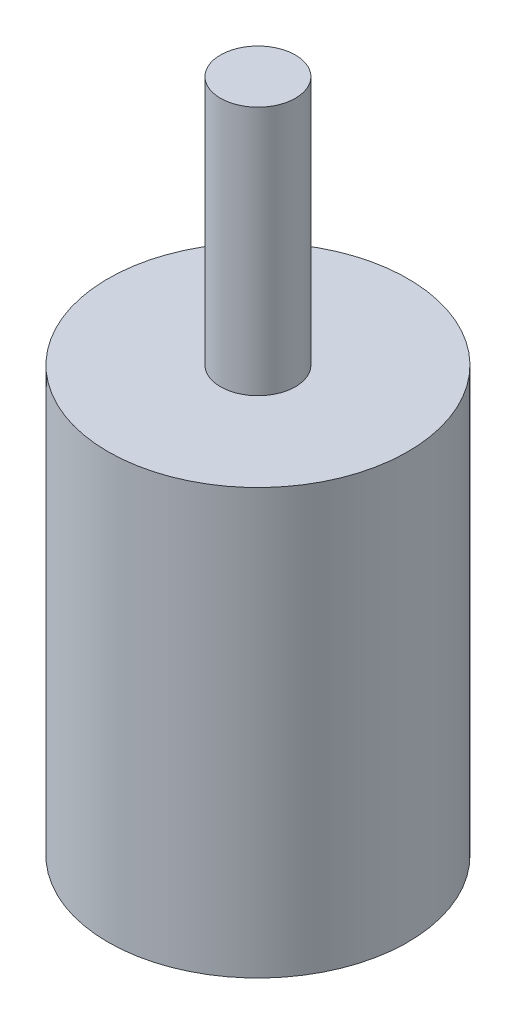
ISO-10303-21;
HEADER;
FILE_DESCRIPTION(('STEP AP214'),'2;1');
FILE_NAME('part.step','',(''),(''),'','','');
FILE_SCHEMA(('AUTOMOTIVE_DESIGN { 1 0 10303 214 1 1 1 1 }'));
ENDSEC;
DATA;
#1=APPLICATION_CONTEXT('core data for automotive mechanical design processes');
#2=APPLICATION_PROTOCOL_DEFINITION('international standard','automotive_design',2000,#1);
#3=PRODUCT_CONTEXT('',#1,'mechanical');
#4=PRODUCT('Part','Part','',(#3));
#5=PRODUCT_RELATED_PRODUCT_CATEGORY('part','',(#4));
#6=PRODUCT_DEFINITION_FORMATION('','',#4);
#7=PRODUCT_DEFINITION_CONTEXT('part definition',#1,'design');
#8=PRODUCT_DEFINITION('design','',#6,#7);
#9=PRODUCT_DEFINITION_SHAPE('','',#8);
#10=(LENGTH_UNIT() NAMED_UNIT(*) SI_UNIT(.MILLI.,.METRE.));
#11=(NAMED_UNIT(*) PLANE_ANGLE_UNIT() SI_UNIT($,.RADIAN.));
#12=(NAMED_UNIT(*) SI_UNIT($,.STERADIAN.) SOLID_ANGLE_UNIT());
#13=UNCERTAINTY_MEASURE_WITH_UNIT(LENGTH_MEASURE(1.E-05),#10,'distance_accuracy_value','');
#14=(GEOMETRIC_REPRESENTATION_CONTEXT(3) GLOBAL_UNCERTAINTY_ASSIGNED_CONTEXT((#13)) GLOBAL_UNIT_ASSIGNED_CONTEXT((#10,
#11,#12)) REPRESENTATION_CONTEXT('',''));
#15=CARTESIAN_POINT('',(0.,0.,0.));
#16=DIRECTION('',(0.,0.,1.));
#17=DIRECTION('',(1.,0.,0.));
#18=AXIS2_PLACEMENT_3D('',#15,#16,#17);
#19=CARTESIAN_POINT('',(0.,17.,0.));
#20=DIRECTION('',(0.,-1.,0.));
#21=DIRECTION('',(0.,0.,-1.));
#22=AXIS2_PLACEMENT_3D('',#19,#20,#21);
#23=CYLINDRICAL_SURFACE('',#22,12.);
#24=CARTESIAN_POINT('',(0.,17.,0.));
#25=DIRECTION('',(0.,1.,0.));
#26=DIRECTION('',(0.,0.,1.));
#27=AXIS2_PLACEMENT_3D('',#24,#25,#26);
#28=CIRCLE('',#27,12.);
#29=CARTESIAN_POINT('',(0.,17.,12.));
#30=VERTEX_POINT('',#29);
#31=EDGE_CURVE('E43',#30,#30,#28,.T.);
#32=ORIENTED_EDGE('',*,*,#31,.F.);
#33=EDGE_LOOP('',(#32));
#34=FACE_BOUND('',#33,.T.);
#35=CARTESIAN_POINT('',(0.,-17.,0.));
#36=DIRECTION('',(0.,1.,0.));
#37=DIRECTION('',(0.,0.,1.));
#38=AXIS2_PLACEMENT_3D('',#35,#36,#37);
#39=CIRCLE('',#38,12.);
#40=CARTESIAN_POINT('',(0.,-17.,12.));
#41=VERTEX_POINT('',#40);
#42=EDGE_CURVE('E39',#41,#41,#39,.T.);
#43=ORIENTED_EDGE('',*,*,#42,.T.);
#44=EDGE_LOOP('',(#43));
#45=FACE_BOUND('',#44,.T.);
#46=ADVANCED_FACE('F36',(#34,#45),#23,.T.);
#47=CARTESIAN_POINT('',(0.,17.,0.));
#48=DIRECTION('',(0.,1.,0.));
#49=DIRECTION('',(0.,0.,1.));
#50=AXIS2_PLACEMENT_3D('',#47,#48,#49);
#51=PLANE('',#50);
#52=CARTESIAN_POINT('',(0.,17.,0.));
#53=DIRECTION('',(0.,1.,0.));
#54=DIRECTION('',(0.,0.,1.));
#55=AXIS2_PLACEMENT_3D('',#52,#53,#54);
#56=CIRCLE('',#55,3.);
#57=CARTESIAN_POINT('',(0.,17.,3.));
#58=VERTEX_POINT('',#57);
#59=EDGE_CURVE('E11',#58,#58,#56,.T.);
#60=ORIENTED_EDGE('',*,*,#59,.F.);
#61=EDGE_LOOP('',(#60));
#62=FACE_BOUND('',#61,.T.);
#63=ORIENTED_EDGE('',*,*,#31,.T.);
#64=EDGE_LOOP('',(#63));
#65=FACE_BOUND('',#64,.T.);
#66=ADVANCED_FACE('F60',(#62,#65),#51,.T.);
#67=CARTESIAN_POINT('',(0.,-17.,0.));
#68=DIRECTION('',(0.,1.,0.));
#69=DIRECTION('',(0.,0.,1.));
#70=AXIS2_PLACEMENT_3D('',#67,#68,#69);
#71=PLANE('',#70);
#72=ORIENTED_EDGE('',*,*,#42,.F.);
#73=EDGE_LOOP('',(#72));
#74=FACE_BOUND('',#73,.T.);
#75=ADVANCED_FACE('F57',(#74),#71,.F.);
#76=CARTESIAN_POINT('',(0.,99.4852813742386,0.));
#77=DIRECTION('',(0.,-1.,0.));
#78=DIRECTION('',(0.,0.,-1.));
#79=AXIS2_PLACEMENT_3D('',#76,#77,#78);
#80=CYLINDRICAL_SURFACE('',#79,3.);
#81=ORIENTED_EDGE('',*,*,#59,.T.);
#82=EDGE_LOOP('',(#81));
#83=FACE_BOUND('',#82,.T.);
#84=CARTESIAN_POINT('',(0.,37.,0.));
#85=DIRECTION('',(0.,1.,0.));
#86=DIRECTION('',(0.,0.,1.));
#87=AXIS2_PLACEMENT_3D('',#84,#85,#86);
#88=CIRCLE('',#87,3.);
#89=CARTESIAN_POINT('',(0.,37.,3.));
#90=VERTEX_POINT('',#89);
#91=EDGE_CURVE('E49',#90,#90,#88,.T.);
#92=ORIENTED_EDGE('',*,*,#91,.F.);
#93=EDGE_LOOP('',(#92));
#94=FACE_BOUND('',#93,.T.);
#95=ADVANCED_FACE('F59',(#83,#94),#80,.T.);
#96=CARTESIAN_POINT('',(0.,37.,0.));
#97=DIRECTION('',(0.,1.,0.));
#98=DIRECTION('',(0.,0.,1.));
#99=AXIS2_PLACEMENT_3D('',#96,#97,#98);
#100=PLANE('',#99);
#101=ORIENTED_EDGE('',*,*,#91,.T.);
#102=EDGE_LOOP('',(#101));
#103=FACE_BOUND('',#102,.T.);
#104=ADVANCED_FACE('F65',(#103),#100,.T.);
#105=CLOSED_SHELL('',(#46,#66,#75,#95,#104));
#106=MANIFOLD_SOLID_BREP('B2',#105);
#107=ADVANCED_BREP_SHAPE_REPRESENTATION('',(#18,#106),#14);
#108=SHAPE_DEFINITION_REPRESENTATION(#9,#107);
ENDSEC;
END-ISO-10303-21;
